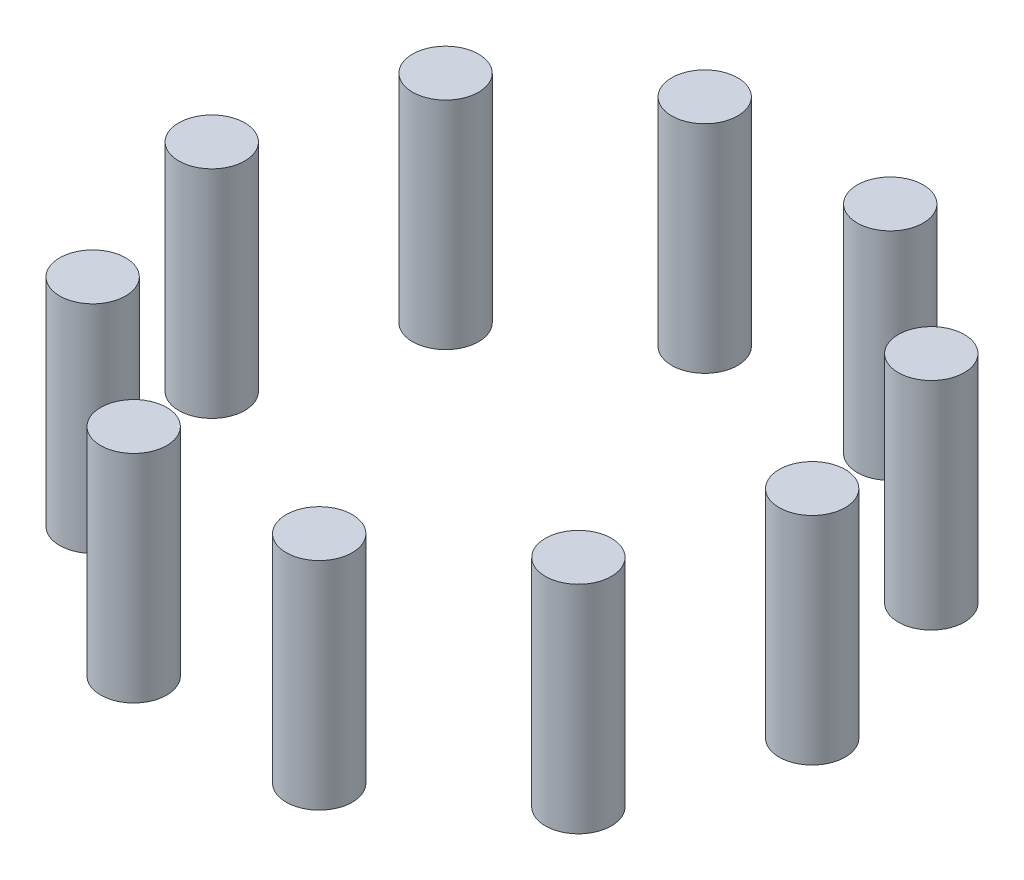
ISO-10303-21;
HEADER;
FILE_DESCRIPTION(('STEP AP214'),'2;1');
FILE_NAME('part.step','',(''),(''),'','','');
FILE_SCHEMA(('AUTOMOTIVE_DESIGN { 1 0 10303 214 1 1 1 1 }'));
ENDSEC;
DATA;
#1=APPLICATION_CONTEXT('core data for automotive mechanical design processes');
#2=APPLICATION_PROTOCOL_DEFINITION('international standard','automotive_design',2000,#1);
#3=PRODUCT_CONTEXT('',#1,'mechanical');
#4=PRODUCT('Part','Part','',(#3));
#5=PRODUCT_RELATED_PRODUCT_CATEGORY('part','',(#4));
#6=PRODUCT_DEFINITION_FORMATION('','',#4);
#7=PRODUCT_DEFINITION_CONTEXT('part definition',#1,'design');
#8=PRODUCT_DEFINITION('design','',#6,#7);
#9=PRODUCT_DEFINITION_SHAPE('','',#8);
#10=(LENGTH_UNIT() NAMED_UNIT(*) SI_UNIT(.MILLI.,.METRE.));
#11=(NAMED_UNIT(*) PLANE_ANGLE_UNIT() SI_UNIT($,.RADIAN.));
#12=(NAMED_UNIT(*) SI_UNIT($,.STERADIAN.) SOLID_ANGLE_UNIT());
#13=UNCERTAINTY_MEASURE_WITH_UNIT(LENGTH_MEASURE(1.E-05),#10,'distance_accuracy_value','');
#14=(GEOMETRIC_REPRESENTATION_CONTEXT(3) GLOBAL_UNCERTAINTY_ASSIGNED_CONTEXT((#13)) GLOBAL_UNIT_ASSIGNED_CONTEXT((#10,
#11,#12)) REPRESENTATION_CONTEXT('',''));
#15=CARTESIAN_POINT('',(0.,0.,0.));
#16=DIRECTION('',(0.,0.,1.));
#17=DIRECTION('',(1.,0.,0.));
#18=AXIS2_PLACEMENT_3D('',#15,#16,#17);
#19=CARTESIAN_POINT('',(-40.4508497187475,36.,29.3892626146234));
#20=DIRECTION('',(0.,-1.,0.));
#21=DIRECTION('',(0.,0.,-1.));
#22=AXIS2_PLACEMENT_3D('',#19,#20,#21);
#23=CYLINDRICAL_SURFACE('',#22,5.5);
#24=CARTESIAN_POINT('',(-40.4508497187475,36.,29.3892626146234));
#25=DIRECTION('',(0.,1.,0.));
#26=DIRECTION('',(0.,0.,1.));
#27=AXIS2_PLACEMENT_3D('',#24,#25,#26);
#28=CIRCLE('',#27,5.5);
#29=CARTESIAN_POINT('',(-40.4508497187475,36.,34.8892626146234));
#30=VERTEX_POINT('',#29);
#31=EDGE_CURVE('E48',#30,#30,#28,.T.);
#32=ORIENTED_EDGE('',*,*,#31,.F.);
#33=EDGE_LOOP('',(#32));
#34=FACE_BOUND('',#33,.T.);
#35=CARTESIAN_POINT('',(-40.4508497187475,0.,29.3892626146234));
#36=DIRECTION('',(0.,1.,0.));
#37=DIRECTION('',(0.,0.,1.));
#38=AXIS2_PLACEMENT_3D('',#35,#36,#37);
#39=CIRCLE('',#38,5.5);
#40=CARTESIAN_POINT('',(-40.4508497187475,0.,34.8892626146234));
#41=VERTEX_POINT('',#40);
#42=EDGE_CURVE('E11',#41,#41,#39,.T.);
#43=ORIENTED_EDGE('',*,*,#42,.T.);
#44=EDGE_LOOP('',(#43));
#45=FACE_BOUND('',#44,.T.);
#46=ADVANCED_FACE('F44',(#34,#45),#23,.T.);
#47=CARTESIAN_POINT('',(-40.4508497187475,36.,29.3892626146234));
#48=DIRECTION('',(0.,1.,0.));
#49=DIRECTION('',(0.,0.,1.));
#50=AXIS2_PLACEMENT_3D('',#47,#48,#49);
#51=PLANE('',#50);
#52=ORIENTED_EDGE('',*,*,#31,.T.);
#53=EDGE_LOOP('',(#52));
#54=FACE_BOUND('',#53,.T.);
#55=ADVANCED_FACE('F46',(#54),#51,.T.);
#56=CARTESIAN_POINT('',(-40.4508497187475,0.,29.3892626146234));
#57=DIRECTION('',(0.,1.,0.));
#58=DIRECTION('',(0.,0.,1.));
#59=AXIS2_PLACEMENT_3D('',#56,#57,#58);
#60=PLANE('',#59);
#61=ORIENTED_EDGE('',*,*,#42,.F.);
#62=EDGE_LOOP('',(#61));
#63=FACE_BOUND('',#62,.T.);
#64=ADVANCED_FACE('F63',(#63),#60,.F.);
#65=CLOSED_SHELL('',(#46,#55,#64));
#66=MANIFOLD_SOLID_BREP('B2',#65);
#67=CARTESIAN_POINT('',(-15.4508497187476,36.,47.5528258147576));
#68=DIRECTION('',(0.,-1.,0.));
#69=DIRECTION('',(0.,0.,-1.));
#70=AXIS2_PLACEMENT_3D('',#67,#68,#69);
#71=CYLINDRICAL_SURFACE('',#70,5.49999999999999);
#72=CARTESIAN_POINT('',(-15.4508497187476,36.,47.5528258147576));
#73=DIRECTION('',(0.,1.,0.));
#74=DIRECTION('',(0.,0.,1.));
#75=AXIS2_PLACEMENT_3D('',#72,#73,#74);
#76=CIRCLE('',#75,5.49999999999999);
#77=CARTESIAN_POINT('',(-15.4508497187476,36.,53.0528258147576));
#78=VERTEX_POINT('',#77);
#79=EDGE_CURVE('E103',#78,#78,#76,.T.);
#80=ORIENTED_EDGE('',*,*,#79,.F.);
#81=EDGE_LOOP('',(#80));
#82=FACE_BOUND('',#81,.T.);
#83=CARTESIAN_POINT('',(-15.4508497187476,0.,47.5528258147576));
#84=DIRECTION('',(0.,1.,0.));
#85=DIRECTION('',(0.,0.,1.));
#86=AXIS2_PLACEMENT_3D('',#83,#84,#85);
#87=CIRCLE('',#86,5.49999999999999);
#88=CARTESIAN_POINT('',(-15.4508497187476,0.,53.0528258147576));
#89=VERTEX_POINT('',#88);
#90=EDGE_CURVE('E43',#89,#89,#87,.T.);
#91=ORIENTED_EDGE('',*,*,#90,.T.);
#92=EDGE_LOOP('',(#91));
#93=FACE_BOUND('',#92,.T.);
#94=ADVANCED_FACE('F99',(#82,#93),#71,.T.);
#95=CARTESIAN_POINT('',(-15.4508497187476,36.,47.5528258147576));
#96=DIRECTION('',(0.,1.,0.));
#97=DIRECTION('',(0.,0.,1.));
#98=AXIS2_PLACEMENT_3D('',#95,#96,#97);
#99=PLANE('',#98);
#100=ORIENTED_EDGE('',*,*,#79,.T.);
#101=EDGE_LOOP('',(#100));
#102=FACE_BOUND('',#101,.T.);
#103=ADVANCED_FACE('F101',(#102),#99,.T.);
#104=CARTESIAN_POINT('',(-15.4508497187476,0.,47.5528258147576));
#105=DIRECTION('',(0.,1.,0.));
#106=DIRECTION('',(0.,0.,1.));
#107=AXIS2_PLACEMENT_3D('',#104,#105,#106);
#108=PLANE('',#107);
#109=ORIENTED_EDGE('',*,*,#90,.F.);
#110=EDGE_LOOP('',(#109));
#111=FACE_BOUND('',#110,.T.);
#112=ADVANCED_FACE('F118',(#111),#108,.F.);
#113=CLOSED_SHELL('',(#94,#103,#112));
#114=MANIFOLD_SOLID_BREP('B6',#113);
#115=CARTESIAN_POINT('',(15.4508497187472,36.,47.5528258147577));
#116=DIRECTION('',(0.,-1.,0.));
#117=DIRECTION('',(0.,0.,-1.));
#118=AXIS2_PLACEMENT_3D('',#115,#116,#117);
#119=CYLINDRICAL_SURFACE('',#118,5.50000000000001);
#120=CARTESIAN_POINT('',(15.4508497187472,36.,47.5528258147577));
#121=DIRECTION('',(0.,1.,0.));
#122=DIRECTION('',(0.,0.,1.));
#123=AXIS2_PLACEMENT_3D('',#120,#121,#122);
#124=CIRCLE('',#123,5.50000000000001);
#125=CARTESIAN_POINT('',(15.4508497187472,36.,53.0528258147577));
#126=VERTEX_POINT('',#125);
#127=EDGE_CURVE('E158',#126,#126,#124,.T.);
#128=ORIENTED_EDGE('',*,*,#127,.F.);
#129=EDGE_LOOP('',(#128));
#130=FACE_BOUND('',#129,.T.);
#131=CARTESIAN_POINT('',(15.4508497187472,0.,47.5528258147577));
#132=DIRECTION('',(0.,1.,0.));
#133=DIRECTION('',(0.,0.,1.));
#134=AXIS2_PLACEMENT_3D('',#131,#132,#133);
#135=CIRCLE('',#134,5.50000000000001);
#136=CARTESIAN_POINT('',(15.4508497187472,0.,53.0528258147577));
#137=VERTEX_POINT('',#136);
#138=EDGE_CURVE('E98',#137,#137,#135,.T.);
#139=ORIENTED_EDGE('',*,*,#138,.T.);
#140=EDGE_LOOP('',(#139));
#141=FACE_BOUND('',#140,.T.);
#142=ADVANCED_FACE('F154',(#130,#141),#119,.T.);
#143=CARTESIAN_POINT('',(15.4508497187472,36.,47.5528258147577));
#144=DIRECTION('',(0.,1.,0.));
#145=DIRECTION('',(0.,0.,1.));
#146=AXIS2_PLACEMENT_3D('',#143,#144,#145);
#147=PLANE('',#146);
#148=ORIENTED_EDGE('',*,*,#127,.T.);
#149=EDGE_LOOP('',(#148));
#150=FACE_BOUND('',#149,.T.);
#151=ADVANCED_FACE('F156',(#150),#147,.T.);
#152=CARTESIAN_POINT('',(15.4508497187472,0.,47.5528258147577));
#153=DIRECTION('',(0.,1.,0.));
#154=DIRECTION('',(0.,0.,1.));
#155=AXIS2_PLACEMENT_3D('',#152,#153,#154);
#156=PLANE('',#155);
#157=ORIENTED_EDGE('',*,*,#138,.F.);
#158=EDGE_LOOP('',(#157));
#159=FACE_BOUND('',#158,.T.);
#160=ADVANCED_FACE('F173',(#159),#156,.F.);
#161=CLOSED_SHELL('',(#142,#151,#160));
#162=MANIFOLD_SOLID_BREP('B38',#161);
#163=CARTESIAN_POINT('',(40.4508497187473,36.,29.3892626146237));
#164=DIRECTION('',(0.,-1.,0.));
#165=DIRECTION('',(0.,0.,-1.));
#166=AXIS2_PLACEMENT_3D('',#163,#164,#165);
#167=CYLINDRICAL_SURFACE('',#166,5.5);
#168=CARTESIAN_POINT('',(40.4508497187473,36.,29.3892626146237));
#169=DIRECTION('',(0.,1.,0.));
#170=DIRECTION('',(0.,0.,1.));
#171=AXIS2_PLACEMENT_3D('',#168,#169,#170);
#172=CIRCLE('',#171,5.5);
#173=CARTESIAN_POINT('',(40.4508497187473,36.,34.8892626146237));
#174=VERTEX_POINT('',#173);
#175=EDGE_CURVE('E213',#174,#174,#172,.T.);
#176=ORIENTED_EDGE('',*,*,#175,.F.);
#177=EDGE_LOOP('',(#176));
#178=FACE_BOUND('',#177,.T.);
#179=CARTESIAN_POINT('',(40.4508497187473,0.,29.3892626146237));
#180=DIRECTION('',(0.,1.,0.));
#181=DIRECTION('',(0.,0.,1.));
#182=AXIS2_PLACEMENT_3D('',#179,#180,#181);
#183=CIRCLE('',#182,5.5);
#184=CARTESIAN_POINT('',(40.4508497187473,0.,34.8892626146237));
#185=VERTEX_POINT('',#184);
#186=EDGE_CURVE('E153',#185,#185,#183,.T.);
#187=ORIENTED_EDGE('',*,*,#186,.T.);
#188=EDGE_LOOP('',(#187));
#189=FACE_BOUND('',#188,.T.);
#190=ADVANCED_FACE('F209',(#178,#189),#167,.T.);
#191=CARTESIAN_POINT('',(40.4508497187473,36.,29.3892626146237));
#192=DIRECTION('',(0.,1.,0.));
#193=DIRECTION('',(0.,0.,1.));
#194=AXIS2_PLACEMENT_3D('',#191,#192,#193);
#195=PLANE('',#194);
#196=ORIENTED_EDGE('',*,*,#175,.T.);
#197=EDGE_LOOP('',(#196));
#198=FACE_BOUND('',#197,.T.);
#199=ADVANCED_FACE('F211',(#198),#195,.T.);
#200=CARTESIAN_POINT('',(40.4508497187473,0.,29.3892626146237));
#201=DIRECTION('',(0.,1.,0.));
#202=DIRECTION('',(0.,0.,1.));
#203=AXIS2_PLACEMENT_3D('',#200,#201,#202);
#204=PLANE('',#203);
#205=ORIENTED_EDGE('',*,*,#186,.F.);
#206=EDGE_LOOP('',(#205));
#207=FACE_BOUND('',#206,.T.);
#208=ADVANCED_FACE('F228',(#207),#204,.F.);
#209=CLOSED_SHELL('',(#190,#199,#208));
#210=MANIFOLD_SOLID_BREP('B93',#209);
#211=CARTESIAN_POINT('',(50.,36.,0.));
#212=DIRECTION('',(0.,-1.,0.));
#213=DIRECTION('',(0.,0.,-1.));
#214=AXIS2_PLACEMENT_3D('',#211,#212,#213);
#215=CYLINDRICAL_SURFACE('',#214,5.5);
#216=CARTESIAN_POINT('',(50.,36.,0.));
#217=DIRECTION('',(0.,1.,0.));
#218=DIRECTION('',(0.,0.,1.));
#219=AXIS2_PLACEMENT_3D('',#216,#217,#218);
#220=CIRCLE('',#219,5.5);
#221=CARTESIAN_POINT('',(50.,36.,5.5));
#222=VERTEX_POINT('',#221);
#223=EDGE_CURVE('E268',#222,#222,#220,.T.);
#224=ORIENTED_EDGE('',*,*,#223,.F.);
#225=EDGE_LOOP('',(#224));
#226=FACE_BOUND('',#225,.T.);
#227=CARTESIAN_POINT('',(50.,0.,0.));
#228=DIRECTION('',(0.,1.,0.));
#229=DIRECTION('',(0.,0.,1.));
#230=AXIS2_PLACEMENT_3D('',#227,#228,#229);
#231=CIRCLE('',#230,5.5);
#232=CARTESIAN_POINT('',(50.,0.,5.5));
#233=VERTEX_POINT('',#232);
#234=EDGE_CURVE('E208',#233,#233,#231,.T.);
#235=ORIENTED_EDGE('',*,*,#234,.T.);
#236=EDGE_LOOP('',(#235));
#237=FACE_BOUND('',#236,.T.);
#238=ADVANCED_FACE('F264',(#226,#237),#215,.T.);
#239=CARTESIAN_POINT('',(50.,36.,0.));
#240=DIRECTION('',(0.,1.,0.));
#241=DIRECTION('',(0.,0.,1.));
#242=AXIS2_PLACEMENT_3D('',#239,#240,#241);
#243=PLANE('',#242);
#244=ORIENTED_EDGE('',*,*,#223,.T.);
#245=EDGE_LOOP('',(#244));
#246=FACE_BOUND('',#245,.T.);
#247=ADVANCED_FACE('F266',(#246),#243,.T.);
#248=CARTESIAN_POINT('',(50.,0.,0.));
#249=DIRECTION('',(0.,1.,0.));
#250=DIRECTION('',(0.,0.,1.));
#251=AXIS2_PLACEMENT_3D('',#248,#249,#250);
#252=PLANE('',#251);
#253=ORIENTED_EDGE('',*,*,#234,.F.);
#254=EDGE_LOOP('',(#253));
#255=FACE_BOUND('',#254,.T.);
#256=ADVANCED_FACE('F283',(#255),#252,.F.);
#257=CLOSED_SHELL('',(#238,#247,#256));
#258=MANIFOLD_SOLID_BREP('B148',#257);
#259=CARTESIAN_POINT('',(40.4508497187478,36.,-29.3892626146231));
#260=DIRECTION('',(0.,-1.,0.));
#261=DIRECTION('',(0.,0.,-1.));
#262=AXIS2_PLACEMENT_3D('',#259,#260,#261);
#263=CYLINDRICAL_SURFACE('',#262,5.49999999999999);
#264=CARTESIAN_POINT('',(40.4508497187478,36.,-29.3892626146231));
#265=DIRECTION('',(0.,1.,0.));
#266=DIRECTION('',(0.,0.,1.));
#267=AXIS2_PLACEMENT_3D('',#264,#265,#266);
#268=CIRCLE('',#267,5.49999999999999);
#269=CARTESIAN_POINT('',(40.4508497187478,36.,-23.8892626146231));
#270=VERTEX_POINT('',#269);
#271=EDGE_CURVE('E323',#270,#270,#268,.T.);
#272=ORIENTED_EDGE('',*,*,#271,.F.);
#273=EDGE_LOOP('',(#272));
#274=FACE_BOUND('',#273,.T.);
#275=CARTESIAN_POINT('',(40.4508497187478,0.,-29.3892626146231));
#276=DIRECTION('',(0.,1.,0.));
#277=DIRECTION('',(0.,0.,1.));
#278=AXIS2_PLACEMENT_3D('',#275,#276,#277);
#279=CIRCLE('',#278,5.49999999999999);
#280=CARTESIAN_POINT('',(40.4508497187478,0.,-23.8892626146231));
#281=VERTEX_POINT('',#280);
#282=EDGE_CURVE('E263',#281,#281,#279,.T.);
#283=ORIENTED_EDGE('',*,*,#282,.T.);
#284=EDGE_LOOP('',(#283));
#285=FACE_BOUND('',#284,.T.);
#286=ADVANCED_FACE('F319',(#274,#285),#263,.T.);
#287=CARTESIAN_POINT('',(40.4508497187478,36.,-29.3892626146231));
#288=DIRECTION('',(0.,1.,0.));
#289=DIRECTION('',(0.,0.,1.));
#290=AXIS2_PLACEMENT_3D('',#287,#288,#289);
#291=PLANE('',#290);
#292=ORIENTED_EDGE('',*,*,#271,.T.);
#293=EDGE_LOOP('',(#292));
#294=FACE_BOUND('',#293,.T.);
#295=ADVANCED_FACE('F321',(#294),#291,.T.);
#296=CARTESIAN_POINT('',(40.4508497187478,0.,-29.3892626146231));
#297=DIRECTION('',(0.,1.,0.));
#298=DIRECTION('',(0.,0.,1.));
#299=AXIS2_PLACEMENT_3D('',#296,#297,#298);
#300=PLANE('',#299);
#301=ORIENTED_EDGE('',*,*,#282,.F.);
#302=EDGE_LOOP('',(#301));
#303=FACE_BOUND('',#302,.T.);
#304=ADVANCED_FACE('F338',(#303),#300,.F.);
#305=CLOSED_SHELL('',(#286,#295,#304));
#306=MANIFOLD_SOLID_BREP('B203',#305);
#307=CARTESIAN_POINT('',(15.4508497187479,36.,-47.5528258147575));
#308=DIRECTION('',(0.,-1.,0.));
#309=DIRECTION('',(0.,0.,-1.));
#310=AXIS2_PLACEMENT_3D('',#307,#308,#309);
#311=CYLINDRICAL_SURFACE('',#310,5.5);
#312=CARTESIAN_POINT('',(15.4508497187479,36.,-47.5528258147575));
#313=DIRECTION('',(0.,1.,0.));
#314=DIRECTION('',(0.,0.,1.));
#315=AXIS2_PLACEMENT_3D('',#312,#313,#314);
#316=CIRCLE('',#315,5.5);
#317=CARTESIAN_POINT('',(15.4508497187479,36.,-42.0528258147575));
#318=VERTEX_POINT('',#317);
#319=EDGE_CURVE('E378',#318,#318,#316,.T.);
#320=ORIENTED_EDGE('',*,*,#319,.F.);
#321=EDGE_LOOP('',(#320));
#322=FACE_BOUND('',#321,.T.);
#323=CARTESIAN_POINT('',(15.4508497187479,0.,-47.5528258147575));
#324=DIRECTION('',(0.,1.,0.));
#325=DIRECTION('',(0.,0.,1.));
#326=AXIS2_PLACEMENT_3D('',#323,#324,#325);
#327=CIRCLE('',#326,5.5);
#328=CARTESIAN_POINT('',(15.4508497187479,0.,-42.0528258147575));
#329=VERTEX_POINT('',#328);
#330=EDGE_CURVE('E318',#329,#329,#327,.T.);
#331=ORIENTED_EDGE('',*,*,#330,.T.);
#332=EDGE_LOOP('',(#331));
#333=FACE_BOUND('',#332,.T.);
#334=ADVANCED_FACE('F374',(#322,#333),#311,.T.);
#335=CARTESIAN_POINT('',(15.4508497187479,36.,-47.5528258147575));
#336=DIRECTION('',(0.,1.,0.));
#337=DIRECTION('',(0.,0.,1.));
#338=AXIS2_PLACEMENT_3D('',#335,#336,#337);
#339=PLANE('',#338);
#340=ORIENTED_EDGE('',*,*,#319,.T.);
#341=EDGE_LOOP('',(#340));
#342=FACE_BOUND('',#341,.T.);
#343=ADVANCED_FACE('F376',(#342),#339,.T.);
#344=CARTESIAN_POINT('',(15.4508497187479,0.,-47.5528258147575));
#345=DIRECTION('',(0.,1.,0.));
#346=DIRECTION('',(0.,0.,1.));
#347=AXIS2_PLACEMENT_3D('',#344,#345,#346);
#348=PLANE('',#347);
#349=ORIENTED_EDGE('',*,*,#330,.F.);
#350=EDGE_LOOP('',(#349));
#351=FACE_BOUND('',#350,.T.);
#352=ADVANCED_FACE('F393',(#351),#348,.F.);
#353=CLOSED_SHELL('',(#334,#343,#352));
#354=MANIFOLD_SOLID_BREP('B258',#353);
#355=CARTESIAN_POINT('',(-15.4508497187469,36.,-47.5528258147578));
#356=DIRECTION('',(0.,-1.,0.));
#357=DIRECTION('',(0.,0.,-1.));
#358=AXIS2_PLACEMENT_3D('',#355,#356,#357);
#359=CYLINDRICAL_SURFACE('',#358,5.5);
#360=CARTESIAN_POINT('',(-15.4508497187469,36.,-47.5528258147578));
#361=DIRECTION('',(0.,1.,0.));
#362=DIRECTION('',(0.,0.,1.));
#363=AXIS2_PLACEMENT_3D('',#360,#361,#362);
#364=CIRCLE('',#363,5.5);
#365=CARTESIAN_POINT('',(-15.4508497187469,36.,-42.0528258147578));
#366=VERTEX_POINT('',#365);
#367=EDGE_CURVE('E433',#366,#366,#364,.T.);
#368=ORIENTED_EDGE('',*,*,#367,.F.);
#369=EDGE_LOOP('',(#368));
#370=FACE_BOUND('',#369,.T.);
#371=CARTESIAN_POINT('',(-15.4508497187469,0.,-47.5528258147578));
#372=DIRECTION('',(0.,1.,0.));
#373=DIRECTION('',(0.,0.,1.));
#374=AXIS2_PLACEMENT_3D('',#371,#372,#373);
#375=CIRCLE('',#374,5.5);
#376=CARTESIAN_POINT('',(-15.4508497187469,0.,-42.0528258147578));
#377=VERTEX_POINT('',#376);
#378=EDGE_CURVE('E373',#377,#377,#375,.T.);
#379=ORIENTED_EDGE('',*,*,#378,.T.);
#380=EDGE_LOOP('',(#379));
#381=FACE_BOUND('',#380,.T.);
#382=ADVANCED_FACE('F429',(#370,#381),#359,.T.);
#383=CARTESIAN_POINT('',(-15.4508497187469,36.,-47.5528258147578));
#384=DIRECTION('',(0.,1.,0.));
#385=DIRECTION('',(0.,0.,1.));
#386=AXIS2_PLACEMENT_3D('',#383,#384,#385);
#387=PLANE('',#386);
#388=ORIENTED_EDGE('',*,*,#367,.T.);
#389=EDGE_LOOP('',(#388));
#390=FACE_BOUND('',#389,.T.);
#391=ADVANCED_FACE('F431',(#390),#387,.T.);
#392=CARTESIAN_POINT('',(-15.4508497187469,0.,-47.5528258147578));
#393=DIRECTION('',(0.,1.,0.));
#394=DIRECTION('',(0.,0.,1.));
#395=AXIS2_PLACEMENT_3D('',#392,#393,#394);
#396=PLANE('',#395);
#397=ORIENTED_EDGE('',*,*,#378,.F.);
#398=EDGE_LOOP('',(#397));
#399=FACE_BOUND('',#398,.T.);
#400=ADVANCED_FACE('F448',(#399),#396,.F.);
#401=CLOSED_SHELL('',(#382,#391,#400));
#402=MANIFOLD_SOLID_BREP('B313',#401);
#403=CARTESIAN_POINT('',(-40.4508497187471,36.,-29.389262614624));
#404=DIRECTION('',(0.,-1.,0.));
#405=DIRECTION('',(0.,0.,-1.));
#406=AXIS2_PLACEMENT_3D('',#403,#404,#405);
#407=CYLINDRICAL_SURFACE('',#406,5.49999999999999);
#408=CARTESIAN_POINT('',(-40.4508497187471,36.,-29.389262614624));
#409=DIRECTION('',(0.,1.,0.));
#410=DIRECTION('',(0.,0.,1.));
#411=AXIS2_PLACEMENT_3D('',#408,#409,#410);
#412=CIRCLE('',#411,5.49999999999999);
#413=CARTESIAN_POINT('',(-40.4508497187471,36.,-23.889262614624));
#414=VERTEX_POINT('',#413);
#415=EDGE_CURVE('E487',#414,#414,#412,.T.);
#416=ORIENTED_EDGE('',*,*,#415,.F.);
#417=EDGE_LOOP('',(#416));
#418=FACE_BOUND('',#417,.T.);
#419=CARTESIAN_POINT('',(-40.4508497187471,0.,-29.389262614624));
#420=DIRECTION('',(0.,1.,0.));
#421=DIRECTION('',(0.,0.,1.));
#422=AXIS2_PLACEMENT_3D('',#419,#420,#421);
#423=CIRCLE('',#422,5.49999999999999);
#424=CARTESIAN_POINT('',(-40.4508497187471,0.,-23.889262614624));
#425=VERTEX_POINT('',#424);
#426=EDGE_CURVE('E428',#425,#425,#423,.T.);
#427=ORIENTED_EDGE('',*,*,#426,.T.);
#428=EDGE_LOOP('',(#427));
#429=FACE_BOUND('',#428,.T.);
#430=ADVANCED_FACE('F483',(#418,#429),#407,.T.);
#431=CARTESIAN_POINT('',(-40.4508497187471,36.,-29.389262614624));
#432=DIRECTION('',(0.,1.,0.));
#433=DIRECTION('',(0.,0.,1.));
#434=AXIS2_PLACEMENT_3D('',#431,#432,#433);
#435=PLANE('',#434);
#436=ORIENTED_EDGE('',*,*,#415,.T.);
#437=EDGE_LOOP('',(#436));
#438=FACE_BOUND('',#437,.T.);
#439=ADVANCED_FACE('F485',(#438),#435,.T.);
#440=CARTESIAN_POINT('',(-40.4508497187471,0.,-29.389262614624));
#441=DIRECTION('',(0.,1.,0.));
#442=DIRECTION('',(0.,0.,1.));
#443=AXIS2_PLACEMENT_3D('',#440,#441,#442);
#444=PLANE('',#443);
#445=ORIENTED_EDGE('',*,*,#426,.F.);
#446=EDGE_LOOP('',(#445));
#447=FACE_BOUND('',#446,.T.);
#448=ADVANCED_FACE('F502',(#447),#444,.F.);
#449=CLOSED_SHELL('',(#430,#439,#448));
#450=MANIFOLD_SOLID_BREP('B368',#449);
#451=CARTESIAN_POINT('',(-50.,36.,-3.49148133884313E-13));
#452=DIRECTION('',(0.,-1.,0.));
#453=DIRECTION('',(0.,0.,-1.));
#454=AXIS2_PLACEMENT_3D('',#451,#452,#453);
#455=CYLINDRICAL_SURFACE('',#454,5.5);
#456=CARTESIAN_POINT('',(-50.,36.,-3.49148133884313E-13));
#457=DIRECTION('',(0.,1.,0.));
#458=DIRECTION('',(0.,0.,1.));
#459=AXIS2_PLACEMENT_3D('',#456,#457,#458);
#460=CIRCLE('',#459,5.5);
#461=CARTESIAN_POINT('',(-50.,36.,5.49999999999965));
#462=VERTEX_POINT('',#461);
#463=EDGE_CURVE('E482',#462,#462,#460,.T.);
#464=ORIENTED_EDGE('',*,*,#463,.F.);
#465=EDGE_LOOP('',(#464));
#466=FACE_BOUND('',#465,.T.);
#467=CARTESIAN_POINT('',(-50.,0.,-3.49148133884313E-13));
#468=DIRECTION('',(0.,1.,0.));
#469=DIRECTION('',(0.,0.,1.));
#470=AXIS2_PLACEMENT_3D('',#467,#468,#469);
#471=CIRCLE('',#470,5.5);
#472=CARTESIAN_POINT('',(-50.,0.,5.49999999999965));
#473=VERTEX_POINT('',#472);
#474=EDGE_CURVE('E533',#473,#473,#471,.T.);
#475=ORIENTED_EDGE('',*,*,#474,.T.);
#476=EDGE_LOOP('',(#475));
#477=FACE_BOUND('',#476,.T.);
#478=ADVANCED_FACE('F530',(#466,#477),#455,.T.);
#479=CARTESIAN_POINT('',(-50.,36.,-3.49148133884313E-13));
#480=DIRECTION('',(0.,1.,0.));
#481=DIRECTION('',(0.,0.,1.));
#482=AXIS2_PLACEMENT_3D('',#479,#480,#481);
#483=PLANE('',#482);
#484=ORIENTED_EDGE('',*,*,#463,.T.);
#485=EDGE_LOOP('',(#484));
#486=FACE_BOUND('',#485,.T.);
#487=ADVANCED_FACE('F545',(#486),#483,.T.);
#488=CARTESIAN_POINT('',(-50.,0.,-3.49148133884313E-13));
#489=DIRECTION('',(0.,1.,0.));
#490=DIRECTION('',(0.,0.,1.));
#491=AXIS2_PLACEMENT_3D('',#488,#489,#490);
#492=PLANE('',#491);
#493=ORIENTED_EDGE('',*,*,#474,.F.);
#494=EDGE_LOOP('',(#493));
#495=FACE_BOUND('',#494,.T.);
#496=ADVANCED_FACE('F543',(#495),#492,.F.);
#497=CLOSED_SHELL('',(#478,#487,#496));
#498=MANIFOLD_SOLID_BREP('B423',#497);
#499=ADVANCED_BREP_SHAPE_REPRESENTATION('',(#18,#66,#114,#162,#210,#258,#306,#354,#402,#450,
#498),#14);
#500=SHAPE_DEFINITION_REPRESENTATION(#9,#499);
ENDSEC;
END-ISO-10303-21;
